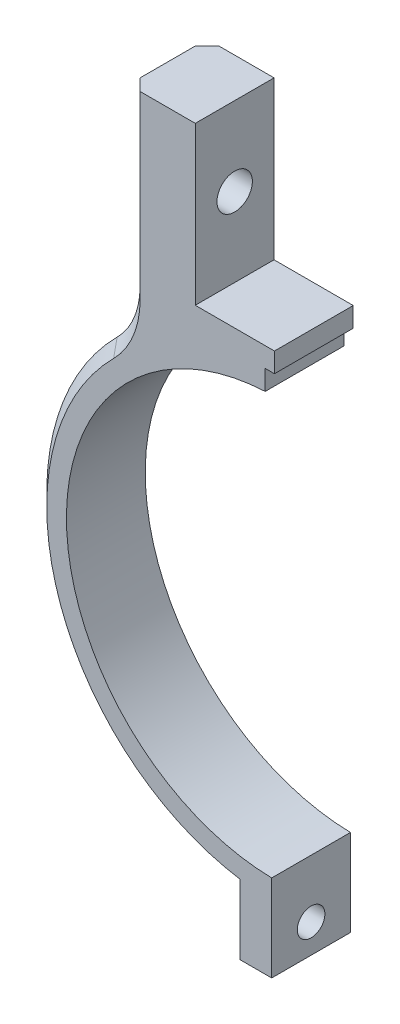
ISO-10303-21;
HEADER;
FILE_DESCRIPTION(('STEP AP214'),'2;1');
FILE_NAME('part.step','',(''),(''),'','','');
FILE_SCHEMA(('AUTOMOTIVE_DESIGN { 1 0 10303 214 1 1 1 1 }'));
ENDSEC;
DATA;
#1=APPLICATION_CONTEXT('core data for automotive mechanical design processes');
#2=APPLICATION_PROTOCOL_DEFINITION('international standard','automotive_design',2000,#1);
#3=PRODUCT_CONTEXT('',#1,'mechanical');
#4=PRODUCT('Part','Part','',(#3));
#5=PRODUCT_RELATED_PRODUCT_CATEGORY('part','',(#4));
#6=PRODUCT_DEFINITION_FORMATION('','',#4);
#7=PRODUCT_DEFINITION_CONTEXT('part definition',#1,'design');
#8=PRODUCT_DEFINITION('design','',#6,#7);
#9=PRODUCT_DEFINITION_SHAPE('','',#8);
#10=(LENGTH_UNIT() NAMED_UNIT(*) SI_UNIT(.MILLI.,.METRE.));
#11=(NAMED_UNIT(*) PLANE_ANGLE_UNIT() SI_UNIT($,.RADIAN.));
#12=(NAMED_UNIT(*) SI_UNIT($,.STERADIAN.) SOLID_ANGLE_UNIT());
#13=UNCERTAINTY_MEASURE_WITH_UNIT(LENGTH_MEASURE(1.E-05),#10,'distance_accuracy_value','');
#14=(GEOMETRIC_REPRESENTATION_CONTEXT(3) GLOBAL_UNCERTAINTY_ASSIGNED_CONTEXT((#13)) GLOBAL_UNIT_ASSIGNED_CONTEXT((#10,
#11,#12)) REPRESENTATION_CONTEXT('',''));
#15=CARTESIAN_POINT('',(0.,0.,0.));
#16=DIRECTION('',(0.,0.,1.));
#17=DIRECTION('',(1.,0.,0.));
#18=AXIS2_PLACEMENT_3D('',#15,#16,#17);
#19=CARTESIAN_POINT('',(-10.2,31.55,10.));
#20=DIRECTION('',(0.,-1.,0.));
#21=DIRECTION('',(0.,0.,-1.));
#22=AXIS2_PLACEMENT_3D('',#19,#20,#21);
#23=PLANE('',#22);
#24=DIRECTION('',(-1.,0.,0.));
#25=VECTOR('',#24,1.);
#26=CARTESIAN_POINT('',(-10.2,31.55,10.));
#27=LINE('',#26,#25);
#28=CARTESIAN_POINT('',(-0.15,31.55,10.));
#29=VERTEX_POINT('',#28);
#30=CARTESIAN_POINT('',(-10.2,31.55,10.));
#31=VERTEX_POINT('',#30);
#32=EDGE_CURVE('E208',#29,#31,#27,.T.);
#33=ORIENTED_EDGE('',*,*,#32,.F.);
#34=DIRECTION('',(0.,0.,1.));
#35=VECTOR('',#34,1.);
#36=CARTESIAN_POINT('',(-0.15,31.55,0.));
#37=LINE('',#36,#35);
#38=CARTESIAN_POINT('',(-0.15,31.55,0.));
#39=VERTEX_POINT('',#38);
#40=EDGE_CURVE('E170',#39,#29,#37,.T.);
#41=ORIENTED_EDGE('',*,*,#40,.F.);
#42=DIRECTION('',(-1.,0.,0.));
#43=VECTOR('',#42,1.);
#44=CARTESIAN_POINT('',(-10.2,31.55,0.));
#45=LINE('',#44,#43);
#46=CARTESIAN_POINT('',(-10.2,31.55,0.));
#47=VERTEX_POINT('',#46);
#48=EDGE_CURVE('E207',#39,#47,#45,.T.);
#49=ORIENTED_EDGE('',*,*,#48,.T.);
#50=DIRECTION('',(0.,0.,-1.));
#51=VECTOR('',#50,1.);
#52=CARTESIAN_POINT('',(-10.2,31.55,10.));
#53=LINE('',#52,#51);
#54=EDGE_CURVE('E257',#31,#47,#53,.T.);
#55=ORIENTED_EDGE('',*,*,#54,.F.);
#56=EDGE_LOOP('',(#33,#41,#49,#55));
#57=FACE_BOUND('',#56,.T.);
#58=ADVANCED_FACE('F38',(#57),#23,.F.);
#59=CARTESIAN_POINT('',(0.,0.,10.));
#60=DIRECTION('',(0.,0.,-1.));
#61=DIRECTION('',(-1.,0.,0.));
#62=AXIS2_PLACEMENT_3D('',#59,#60,#61);
#63=CYLINDRICAL_SURFACE('',#62,26.55);
#64=CARTESIAN_POINT('',(0.,0.,0.));
#65=DIRECTION('',(0.,0.,-1.));
#66=DIRECTION('',(1.,0.,0.));
#67=AXIS2_PLACEMENT_3D('',#64,#65,#66);
#68=CIRCLE('',#67,26.55);
#69=CARTESIAN_POINT('',(-0.50000000000001,-26.5452914845552,0.));
#70=VERTEX_POINT('',#69);
#71=CARTESIAN_POINT('',(-1.325,26.5169167702431,0.));
#72=VERTEX_POINT('',#71);
#73=EDGE_CURVE('E211',#70,#72,#68,.T.);
#74=ORIENTED_EDGE('',*,*,#73,.T.);
#75=DIRECTION('',(0.,0.,-1.));
#76=VECTOR('',#75,1.);
#77=CARTESIAN_POINT('',(-1.325,26.5169167702431,10.));
#78=LINE('',#77,#76);
#79=CARTESIAN_POINT('',(-1.325,26.5169167702431,10.));
#80=VERTEX_POINT('',#79);
#81=EDGE_CURVE('E57',#72,#80,#78,.F.);
#82=ORIENTED_EDGE('',*,*,#81,.T.);
#83=CARTESIAN_POINT('',(0.,0.,10.));
#84=DIRECTION('',(0.,0.,-1.));
#85=DIRECTION('',(1.,0.,0.));
#86=AXIS2_PLACEMENT_3D('',#83,#84,#85);
#87=CIRCLE('',#86,26.55);
#88=CARTESIAN_POINT('',(-0.50000000000001,-26.5452914845552,10.));
#89=VERTEX_POINT('',#88);
#90=EDGE_CURVE('E222',#89,#80,#87,.T.);
#91=ORIENTED_EDGE('',*,*,#90,.F.);
#92=DIRECTION('',(0.,0.,-1.));
#93=VECTOR('',#92,1.);
#94=CARTESIAN_POINT('',(-0.50000000000001,-26.5452914845552,10.));
#95=LINE('',#94,#93);
#96=EDGE_CURVE('E225',#89,#70,#95,.T.);
#97=ORIENTED_EDGE('',*,*,#96,.T.);
#98=EDGE_LOOP('',(#74,#82,#91,#97));
#99=FACE_BOUND('',#98,.T.);
#100=ADVANCED_FACE('F345',(#99),#63,.F.);
#101=CARTESIAN_POINT('',(0.,0.,10.));
#102=DIRECTION('',(0.,0.,1.));
#103=DIRECTION('',(1.,0.,0.));
#104=AXIS2_PLACEMENT_3D('',#101,#102,#103);
#105=PLANE('',#104);
#106=DIRECTION('',(0.,-1.,0.));
#107=VECTOR('',#106,1.);
#108=CARTESIAN_POINT('',(-0.15,29.05,10.));
#109=LINE('',#108,#107);
#110=CARTESIAN_POINT('',(-0.15,29.05,10.));
#111=VERTEX_POINT('',#110);
#112=EDGE_CURVE('E180',#29,#111,#109,.T.);
#113=ORIENTED_EDGE('',*,*,#112,.F.);
#114=ORIENTED_EDGE('',*,*,#32,.T.);
#115=DIRECTION('',(0.,1.,0.));
#116=VECTOR('',#115,1.);
#117=CARTESIAN_POINT('',(-10.2,31.55,10.));
#118=LINE('',#117,#116);
#119=CARTESIAN_POINT('',(-10.2,51.55,10.));
#120=VERTEX_POINT('',#119);
#121=EDGE_CURVE('E210',#31,#120,#118,.T.);
#122=ORIENTED_EDGE('',*,*,#121,.T.);
#123=DIRECTION('',(-1.,0.,0.));
#124=VECTOR('',#123,1.);
#125=CARTESIAN_POINT('',(-10.2,51.55,10.));
#126=LINE('',#125,#124);
#127=CARTESIAN_POINT('',(-17.2,51.55,10.));
#128=VERTEX_POINT('',#127);
#129=EDGE_CURVE('E213',#120,#128,#126,.T.);
#130=ORIENTED_EDGE('',*,*,#129,.T.);
#131=DIRECTION('',(0.,-1.,0.));
#132=VECTOR('',#131,1.);
#133=CARTESIAN_POINT('',(-17.2,28.6463348440948,10.));
#134=LINE('',#133,#132);
#135=CARTESIAN_POINT('',(-17.2,28.6463348440948,10.));
#136=VERTEX_POINT('',#135);
#137=EDGE_CURVE('E271',#128,#136,#134,.T.);
#138=ORIENTED_EDGE('',*,*,#137,.T.);
#139=CARTESIAN_POINT('',(-28.7,28.6463348440948,10.));
#140=DIRECTION('',(0.,0.,1.));
#141=DIRECTION('',(1.,0.,0.));
#142=AXIS2_PLACEMENT_3D('',#139,#140,#141);
#143=CIRCLE('',#142,11.5);
#144=CARTESIAN_POINT('',(-20.5606658446363,20.5222201534144,10.));
#145=VERTEX_POINT('',#144);
#146=EDGE_CURVE('E269',#136,#145,#143,.F.);
#147=ORIENTED_EDGE('',*,*,#146,.T.);
#148=CARTESIAN_POINT('',(0.,0.,10.));
#149=DIRECTION('',(0.,0.,1.));
#150=DIRECTION('',(1.,0.,0.));
#151=AXIS2_PLACEMENT_3D('',#148,#149,#150);
#152=CIRCLE('',#151,29.05);
#153=CARTESIAN_POINT('',(-4.5,-28.6993466824595,10.));
#154=VERTEX_POINT('',#153);
#155=EDGE_CURVE('E266',#145,#154,#152,.T.);
#156=ORIENTED_EDGE('',*,*,#155,.T.);
#157=DIRECTION('',(0.,-1.,0.));
#158=VECTOR('',#157,1.);
#159=CARTESIAN_POINT('',(-4.5,-37.5459080729318,10.));
#160=LINE('',#159,#158);
#161=CARTESIAN_POINT('',(-4.5,-37.5459080729318,10.));
#162=VERTEX_POINT('',#161);
#163=EDGE_CURVE('E216',#154,#162,#160,.T.);
#164=ORIENTED_EDGE('',*,*,#163,.T.);
#165=DIRECTION('',(1.,0.,0.));
#166=VECTOR('',#165,1.);
#167=CARTESIAN_POINT('',(-0.499999999999996,-37.5459080729318,10.));
#168=LINE('',#167,#166);
#169=CARTESIAN_POINT('',(-0.499999999999996,-37.5459080729318,10.));
#170=VERTEX_POINT('',#169);
#171=EDGE_CURVE('E218',#162,#170,#168,.T.);
#172=ORIENTED_EDGE('',*,*,#171,.T.);
#173=DIRECTION('',(0.,1.,0.));
#174=VECTOR('',#173,1.);
#175=CARTESIAN_POINT('',(-0.499999999999996,-30.5459080729318,10.));
#176=LINE('',#175,#174);
#177=EDGE_CURVE('E220',#170,#89,#176,.T.);
#178=ORIENTED_EDGE('',*,*,#177,.T.);
#179=ORIENTED_EDGE('',*,*,#90,.T.);
#180=DIRECTION('',(0.,-1.,0.));
#181=VECTOR('',#180,1.);
#182=CARTESIAN_POINT('',(-1.325,29.05,10.));
#183=LINE('',#182,#181);
#184=CARTESIAN_POINT('',(-1.325,29.05,10.));
#185=VERTEX_POINT('',#184);
#186=EDGE_CURVE('E183',#185,#80,#183,.T.);
#187=ORIENTED_EDGE('',*,*,#186,.F.);
#188=DIRECTION('',(-1.,0.,0.));
#189=VECTOR('',#188,1.);
#190=CARTESIAN_POINT('',(-0.15,29.05,10.));
#191=LINE('',#190,#189);
#192=EDGE_CURVE('E168',#111,#185,#191,.T.);
#193=ORIENTED_EDGE('',*,*,#192,.F.);
#194=EDGE_LOOP('',(#113,#114,#122,#130,#138,#147,#156,#164,#172,#178,#179,#187,#193));
#195=FACE_BOUND('',#194,.T.);
#196=ADVANCED_FACE('F351',(#195),#105,.T.);
#197=CARTESIAN_POINT('',(0.,0.,0.));
#198=DIRECTION('',(0.,0.,1.));
#199=DIRECTION('',(1.,0.,0.));
#200=AXIS2_PLACEMENT_3D('',#197,#198,#199);
#201=PLANE('',#200);
#202=ORIENTED_EDGE('',*,*,#48,.F.);
#203=DIRECTION('',(0.,-1.,0.));
#204=VECTOR('',#203,1.);
#205=CARTESIAN_POINT('',(-0.15,29.05,0.));
#206=LINE('',#205,#204);
#207=CARTESIAN_POINT('',(-0.15,29.05,0.));
#208=VERTEX_POINT('',#207);
#209=EDGE_CURVE('E171',#39,#208,#206,.T.);
#210=ORIENTED_EDGE('',*,*,#209,.T.);
#211=DIRECTION('',(-1.,0.,0.));
#212=VECTOR('',#211,1.);
#213=CARTESIAN_POINT('',(-0.15,29.05,0.));
#214=LINE('',#213,#212);
#215=CARTESIAN_POINT('',(-1.325,29.05,0.));
#216=VERTEX_POINT('',#215);
#217=EDGE_CURVE('E165',#208,#216,#214,.T.);
#218=ORIENTED_EDGE('',*,*,#217,.T.);
#219=DIRECTION('',(0.,-1.,0.));
#220=VECTOR('',#219,1.);
#221=CARTESIAN_POINT('',(-1.325,29.05,0.));
#222=LINE('',#221,#220);
#223=EDGE_CURVE('E173',#216,#72,#222,.T.);
#224=ORIENTED_EDGE('',*,*,#223,.T.);
#225=ORIENTED_EDGE('',*,*,#73,.F.);
#226=DIRECTION('',(0.,1.,0.));
#227=VECTOR('',#226,1.);
#228=CARTESIAN_POINT('',(-0.499999999999997,-26.5452914845552,0.));
#229=LINE('',#228,#227);
#230=CARTESIAN_POINT('',(-0.499999999999996,-37.5459080729318,0.));
#231=VERTEX_POINT('',#230);
#232=EDGE_CURVE('E237',#231,#70,#229,.T.);
#233=ORIENTED_EDGE('',*,*,#232,.F.);
#234=DIRECTION('',(1.,0.,0.));
#235=VECTOR('',#234,1.);
#236=CARTESIAN_POINT('',(-0.499999999999996,-37.5459080729318,0.));
#237=LINE('',#236,#235);
#238=CARTESIAN_POINT('',(-4.5,-37.5459080729318,0.));
#239=VERTEX_POINT('',#238);
#240=EDGE_CURVE('E234',#239,#231,#237,.T.);
#241=ORIENTED_EDGE('',*,*,#240,.F.);
#242=DIRECTION('',(0.,-1.,0.));
#243=VECTOR('',#242,1.);
#244=CARTESIAN_POINT('',(-4.5,-37.5459080729318,0.));
#245=LINE('',#244,#243);
#246=CARTESIAN_POINT('',(-4.5,-28.6993466824595,0.));
#247=VERTEX_POINT('',#246);
#248=EDGE_CURVE('E232',#247,#239,#245,.T.);
#249=ORIENTED_EDGE('',*,*,#248,.F.);
#250=CARTESIAN_POINT('',(0.,0.,0.));
#251=DIRECTION('',(0.,0.,1.));
#252=DIRECTION('',(1.,0.,0.));
#253=AXIS2_PLACEMENT_3D('',#250,#251,#252);
#254=CIRCLE('',#253,29.05);
#255=CARTESIAN_POINT('',(-20.5606658446363,20.5222201534144,0.));
#256=VERTEX_POINT('',#255);
#257=EDGE_CURVE('E293',#247,#256,#254,.F.);
#258=ORIENTED_EDGE('',*,*,#257,.T.);
#259=CARTESIAN_POINT('',(-28.7,28.6463348440948,0.));
#260=DIRECTION('',(0.,0.,1.));
#261=DIRECTION('',(1.,0.,0.));
#262=AXIS2_PLACEMENT_3D('',#259,#260,#261);
#263=CIRCLE('',#262,11.5);
#264=CARTESIAN_POINT('',(-17.2,28.6463348440948,0.));
#265=VERTEX_POINT('',#264);
#266=EDGE_CURVE('E65',#256,#265,#263,.T.);
#267=ORIENTED_EDGE('',*,*,#266,.T.);
#268=DIRECTION('',(0.,1.,0.));
#269=VECTOR('',#268,1.);
#270=CARTESIAN_POINT('',(-17.2,0.,0.));
#271=LINE('',#270,#269);
#272=CARTESIAN_POINT('',(-17.2,51.55,0.));
#273=VERTEX_POINT('',#272);
#274=EDGE_CURVE('E296',#265,#273,#271,.T.);
#275=ORIENTED_EDGE('',*,*,#274,.T.);
#276=DIRECTION('',(-1.,0.,0.));
#277=VECTOR('',#276,1.);
#278=CARTESIAN_POINT('',(-10.2,51.55,0.));
#279=LINE('',#278,#277);
#280=CARTESIAN_POINT('',(-10.2,51.55,0.));
#281=VERTEX_POINT('',#280);
#282=EDGE_CURVE('E229',#281,#273,#279,.T.);
#283=ORIENTED_EDGE('',*,*,#282,.F.);
#284=DIRECTION('',(0.,1.,0.));
#285=VECTOR('',#284,1.);
#286=CARTESIAN_POINT('',(-10.2,31.55,0.));
#287=LINE('',#286,#285);
#288=EDGE_CURVE('E227',#47,#281,#287,.T.);
#289=ORIENTED_EDGE('',*,*,#288,.F.);
#290=EDGE_LOOP('',(#202,#210,#218,#224,#225,#233,#241,#249,#258,#267,#275,#283,#289));
#291=FACE_BOUND('',#290,.T.);
#292=ADVANCED_FACE('F179',(#291),#201,.F.);
#293=CARTESIAN_POINT('',(-10.2,31.55,10.));
#294=DIRECTION('',(-1.,0.,0.));
#295=DIRECTION('',(0.,0.,1.));
#296=AXIS2_PLACEMENT_3D('',#293,#294,#295);
#297=PLANE('',#296);
#298=CARTESIAN_POINT('',(-10.2,41.55,5.));
#299=DIRECTION('',(-1.,0.,0.));
#300=DIRECTION('',(0.,0.,1.));
#301=AXIS2_PLACEMENT_3D('',#298,#299,#300);
#302=CIRCLE('',#301,2.25);
#303=CARTESIAN_POINT('',(-10.2,41.55,7.25));
#304=VERTEX_POINT('',#303);
#305=EDGE_CURVE('E197',#304,#304,#302,.T.);
#306=ORIENTED_EDGE('',*,*,#305,.T.);
#307=EDGE_LOOP('',(#306));
#308=FACE_BOUND('',#307,.T.);
#309=ORIENTED_EDGE('',*,*,#288,.T.);
#310=DIRECTION('',(0.,0.,-1.));
#311=VECTOR('',#310,1.);
#312=CARTESIAN_POINT('',(-10.2,51.55,10.));
#313=LINE('',#312,#311);
#314=EDGE_CURVE('E254',#120,#281,#313,.T.);
#315=ORIENTED_EDGE('',*,*,#314,.F.);
#316=ORIENTED_EDGE('',*,*,#121,.F.);
#317=ORIENTED_EDGE('',*,*,#54,.T.);
#318=EDGE_LOOP('',(#309,#315,#316,#317));
#319=FACE_BOUND('',#318,.T.);
#320=ADVANCED_FACE('F357',(#308,#319),#297,.F.);
#321=CARTESIAN_POINT('',(-10.2,51.55,10.));
#322=DIRECTION('',(0.,-1.,0.));
#323=DIRECTION('',(0.,0.,-1.));
#324=AXIS2_PLACEMENT_3D('',#321,#322,#323);
#325=PLANE('',#324);
#326=DIRECTION('',(0.,0.,-1.));
#327=VECTOR('',#326,1.);
#328=CARTESIAN_POINT('',(-18.7,51.55,10.));
#329=LINE('',#328,#327);
#330=CARTESIAN_POINT('',(-18.7,51.55,8.5));
#331=VERTEX_POINT('',#330);
#332=CARTESIAN_POINT('',(-18.7,51.55,1.49999999999999));
#333=VERTEX_POINT('',#332);
#334=EDGE_CURVE('E251',#331,#333,#329,.T.);
#335=ORIENTED_EDGE('',*,*,#334,.F.);
#336=DIRECTION('',(0.707106781186545,0.,0.70710678118655));
#337=VECTOR('',#336,1.);
#338=CARTESIAN_POINT('',(-17.2,51.55,10.));
#339=LINE('',#338,#337);
#340=EDGE_CURVE('E282',#331,#128,#339,.T.);
#341=ORIENTED_EDGE('',*,*,#340,.T.);
#342=ORIENTED_EDGE('',*,*,#129,.F.);
#343=ORIENTED_EDGE('',*,*,#314,.T.);
#344=ORIENTED_EDGE('',*,*,#282,.T.);
#345=DIRECTION('',(0.707106781186548,0.,-0.707106781186547));
#346=VECTOR('',#345,1.);
#347=CARTESIAN_POINT('',(-18.7,51.55,1.49999999999999));
#348=LINE('',#347,#346);
#349=EDGE_CURVE('E280',#273,#333,#348,.F.);
#350=ORIENTED_EDGE('',*,*,#349,.T.);
#351=EDGE_LOOP('',(#335,#341,#342,#343,#344,#350));
#352=FACE_BOUND('',#351,.T.);
#353=ADVANCED_FACE('F378',(#352),#325,.F.);
#354=CARTESIAN_POINT('',(-18.7,51.55,10.));
#355=DIRECTION('',(1.,0.,0.));
#356=DIRECTION('',(0.,1.,0.));
#357=AXIS2_PLACEMENT_3D('',#354,#355,#356);
#358=PLANE('',#357);
#359=CARTESIAN_POINT('',(-18.7,41.55,5.));
#360=DIRECTION('',(-1.,0.,0.));
#361=DIRECTION('',(0.,-1.,0.));
#362=AXIS2_PLACEMENT_3D('',#359,#360,#361);
#363=CIRCLE('',#362,2.25);
#364=CARTESIAN_POINT('',(-18.7,39.3,5.));
#365=VERTEX_POINT('',#364);
#366=EDGE_CURVE('E194',#365,#365,#363,.T.);
#367=ORIENTED_EDGE('',*,*,#366,.F.);
#368=EDGE_LOOP('',(#367));
#369=FACE_BOUND('',#368,.T.);
#370=DIRECTION('',(0.,0.,1.));
#371=VECTOR('',#370,1.);
#372=CARTESIAN_POINT('',(-18.7,28.6463348440948,10.));
#373=LINE('',#372,#371);
#374=CARTESIAN_POINT('',(-18.7,28.6463348440948,1.49999999999999));
#375=VERTEX_POINT('',#374);
#376=CARTESIAN_POINT('',(-18.7,28.6463348440948,8.5));
#377=VERTEX_POINT('',#376);
#378=EDGE_CURVE('E263',#375,#377,#373,.T.);
#379=ORIENTED_EDGE('',*,*,#378,.T.);
#380=DIRECTION('',(0.,1.,0.));
#381=VECTOR('',#380,1.);
#382=CARTESIAN_POINT('',(-18.7,51.55,8.5));
#383=LINE('',#382,#381);
#384=EDGE_CURVE('E278',#377,#331,#383,.T.);
#385=ORIENTED_EDGE('',*,*,#384,.T.);
#386=ORIENTED_EDGE('',*,*,#334,.T.);
#387=DIRECTION('',(0.,-1.,0.));
#388=VECTOR('',#387,1.);
#389=CARTESIAN_POINT('',(-18.7,51.55,1.49999999999999));
#390=LINE('',#389,#388);
#391=EDGE_CURVE('E274',#333,#375,#390,.T.);
#392=ORIENTED_EDGE('',*,*,#391,.T.);
#393=EDGE_LOOP('',(#379,#385,#386,#392));
#394=FACE_BOUND('',#393,.T.);
#395=ADVANCED_FACE('F453',(#369,#394),#358,.F.);
#396=CARTESIAN_POINT('',(0.,0.,10.));
#397=DIRECTION('',(0.,0.,-1.));
#398=DIRECTION('',(-1.,0.,0.));
#399=AXIS2_PLACEMENT_3D('',#396,#397,#398);
#400=CYLINDRICAL_SURFACE('',#399,30.55);
#401=DIRECTION('',(0.,0.,-1.));
#402=VECTOR('',#401,1.);
#403=CARTESIAN_POINT('',(-4.5,-30.2167585951902,10.));
#404=LINE('',#403,#402);
#405=CARTESIAN_POINT('',(-4.5,-30.2167585951902,8.5));
#406=VERTEX_POINT('',#405);
#407=CARTESIAN_POINT('',(-4.5,-30.2167585951902,1.49999999999999));
#408=VERTEX_POINT('',#407);
#409=EDGE_CURVE('E248',#406,#408,#404,.T.);
#410=ORIENTED_EDGE('',*,*,#409,.F.);
#411=CARTESIAN_POINT('',(0.,0.,8.5));
#412=DIRECTION('',(0.,0.,1.));
#413=DIRECTION('',(1.,0.,0.));
#414=AXIS2_PLACEMENT_3D('',#411,#412,#413);
#415=CIRCLE('',#414,30.55);
#416=CARTESIAN_POINT('',(-21.6223181257707,21.5818872869814,8.5));
#417=VERTEX_POINT('',#416);
#418=EDGE_CURVE('E291',#406,#417,#415,.F.);
#419=ORIENTED_EDGE('',*,*,#418,.T.);
#420=DIRECTION('',(0.,0.,-1.));
#421=VECTOR('',#420,1.);
#422=CARTESIAN_POINT('',(-21.6223181257707,21.5818872869814,10.));
#423=LINE('',#422,#421);
#424=CARTESIAN_POINT('',(-21.6223181257707,21.5818872869814,1.49999999999999));
#425=VERTEX_POINT('',#424);
#426=EDGE_CURVE('E260',#417,#425,#423,.T.);
#427=ORIENTED_EDGE('',*,*,#426,.T.);
#428=CARTESIAN_POINT('',(0.,0.,1.49999999999999));
#429=DIRECTION('',(0.,0.,1.));
#430=DIRECTION('',(1.,0.,0.));
#431=AXIS2_PLACEMENT_3D('',#428,#429,#430);
#432=CIRCLE('',#431,30.55);
#433=EDGE_CURVE('E289',#425,#408,#432,.T.);
#434=ORIENTED_EDGE('',*,*,#433,.T.);
#435=EDGE_LOOP('',(#410,#419,#427,#434));
#436=FACE_BOUND('',#435,.T.);
#437=ADVANCED_FACE('F405',(#436),#400,.T.);
#438=CARTESIAN_POINT('',(-4.5,-37.5459080729318,10.));
#439=DIRECTION('',(1.,0.,0.));
#440=DIRECTION('',(0.,1.,0.));
#441=AXIS2_PLACEMENT_3D('',#438,#439,#440);
#442=PLANE('',#441);
#443=CARTESIAN_POINT('',(-4.50000000000001,-33.881333334061,5.));
#444=DIRECTION('',(-1.,0.,0.));
#445=DIRECTION('',(0.,0.,1.));
#446=AXIS2_PLACEMENT_3D('',#443,#444,#445);
#447=CIRCLE('',#446,1.75);
#448=CARTESIAN_POINT('',(-4.50000000000001,-33.881333334061,6.75));
#449=VERTEX_POINT('',#448);
#450=EDGE_CURVE('E201',#449,#449,#447,.T.);
#451=ORIENTED_EDGE('',*,*,#450,.F.);
#452=EDGE_LOOP('',(#451));
#453=FACE_BOUND('',#452,.T.);
#454=ORIENTED_EDGE('',*,*,#248,.T.);
#455=DIRECTION('',(0.,0.,-1.));
#456=VECTOR('',#455,1.);
#457=CARTESIAN_POINT('',(-4.5,-37.5459080729318,10.));
#458=LINE('',#457,#456);
#459=EDGE_CURVE('E245',#162,#239,#458,.T.);
#460=ORIENTED_EDGE('',*,*,#459,.F.);
#461=ORIENTED_EDGE('',*,*,#163,.F.);
#462=CARTESIAN_POINT('',(-4.5,-28.6993466824595,10.));
#463=CARTESIAN_POINT('',(-4.5,-28.9523221236118,9.75007430809185));
#464=CARTESIAN_POINT('',(-4.5,-29.2052608369842,9.50011146206985));
#465=CARTESIAN_POINT('',(-4.5,-29.7110648078943,9.00011146206977));
#466=CARTESIAN_POINT('',(-4.5,-29.9639300654322,8.75007430809177));
#467=CARTESIAN_POINT('',(-4.5,-30.2167585951902,8.5));
#468=B_SPLINE_CURVE_WITH_KNOTS('',3,(#462,#463,#464,#465,#466,#467),.UNSPECIFIED.,.F.,.F.,(4,2,
4),(0.,1.06683398615948,2.13366797115995),.UNSPECIFIED.);
#469=EDGE_CURVE('E49',#154,#406,#468,.T.);
#470=ORIENTED_EDGE('',*,*,#469,.T.);
#471=ORIENTED_EDGE('',*,*,#409,.T.);
#472=CARTESIAN_POINT('',(-4.5,-30.2167585951902,1.49999999999999));
#473=CARTESIAN_POINT('',(-4.5,-29.9639300654322,1.24992569190823));
#474=CARTESIAN_POINT('',(-4.5,-29.7110648078943,0.999888537930223));
#475=CARTESIAN_POINT('',(-4.5,-29.2052608369841,0.499888537930146));
#476=CARTESIAN_POINT('',(-4.5,-28.9523221236118,0.249925691908151));
#477=CARTESIAN_POINT('',(-4.5,-28.6993466824595,0.));
#478=B_SPLINE_CURVE_WITH_KNOTS('',3,(#472,#473,#474,#475,#476,#477),.UNSPECIFIED.,.F.,.F.,(4,2,
4),(0.,1.06683398500047,2.13366797115995),.UNSPECIFIED.);
#479=EDGE_CURVE('E11',#408,#247,#478,.T.);
#480=ORIENTED_EDGE('',*,*,#479,.T.);
#481=EDGE_LOOP('',(#454,#460,#461,#470,#471,#480));
#482=FACE_BOUND('',#481,.T.);
#483=ADVANCED_FACE('F309',(#453,#482),#442,.F.);
#484=CARTESIAN_POINT('',(-0.499999999999996,-37.5459080729318,10.));
#485=DIRECTION('',(0.,1.,0.));
#486=DIRECTION('',(0.,0.,1.));
#487=AXIS2_PLACEMENT_3D('',#484,#485,#486);
#488=PLANE('',#487);
#489=ORIENTED_EDGE('',*,*,#240,.T.);
#490=DIRECTION('',(0.,0.,-1.));
#491=VECTOR('',#490,1.);
#492=CARTESIAN_POINT('',(-0.499999999999996,-37.5459080729318,10.));
#493=LINE('',#492,#491);
#494=EDGE_CURVE('E242',#170,#231,#493,.T.);
#495=ORIENTED_EDGE('',*,*,#494,.F.);
#496=ORIENTED_EDGE('',*,*,#171,.F.);
#497=ORIENTED_EDGE('',*,*,#459,.T.);
#498=EDGE_LOOP('',(#489,#495,#496,#497));
#499=FACE_BOUND('',#498,.T.);
#500=ADVANCED_FACE('F413',(#499),#488,.F.);
#501=CARTESIAN_POINT('',(-0.499999999999997,-26.5452914845552,10.));
#502=DIRECTION('',(-1.,0.,0.));
#503=DIRECTION('',(0.,-1.,0.));
#504=AXIS2_PLACEMENT_3D('',#501,#502,#503);
#505=PLANE('',#504);
#506=CARTESIAN_POINT('',(-0.499999999999997,-33.881333334061,5.));
#507=DIRECTION('',(-1.,0.,0.));
#508=DIRECTION('',(0.,-1.,0.));
#509=AXIS2_PLACEMENT_3D('',#506,#507,#508);
#510=CIRCLE('',#509,1.75);
#511=CARTESIAN_POINT('',(-0.499999999999997,-35.631333334061,5.));
#512=VERTEX_POINT('',#511);
#513=EDGE_CURVE('E204',#512,#512,#510,.T.);
#514=ORIENTED_EDGE('',*,*,#513,.T.);
#515=EDGE_LOOP('',(#514));
#516=FACE_BOUND('',#515,.T.);
#517=ORIENTED_EDGE('',*,*,#232,.T.);
#518=ORIENTED_EDGE('',*,*,#96,.F.);
#519=ORIENTED_EDGE('',*,*,#177,.F.);
#520=ORIENTED_EDGE('',*,*,#494,.T.);
#521=EDGE_LOOP('',(#517,#518,#519,#520));
#522=FACE_BOUND('',#521,.T.);
#523=ADVANCED_FACE('F417',(#516,#522),#505,.F.);
#524=CARTESIAN_POINT('',(30.55,-33.881333334061,5.));
#525=DIRECTION('',(-1.,0.,0.));
#526=DIRECTION('',(0.,0.,1.));
#527=AXIS2_PLACEMENT_3D('',#524,#525,#526);
#528=CYLINDRICAL_SURFACE('',#527,1.75);
#529=ORIENTED_EDGE('',*,*,#450,.T.);
#530=EDGE_LOOP('',(#529));
#531=FACE_BOUND('',#530,.T.);
#532=ORIENTED_EDGE('',*,*,#513,.F.);
#533=EDGE_LOOP('',(#532));
#534=FACE_BOUND('',#533,.T.);
#535=ADVANCED_FACE('F434',(#531,#534),#528,.F.);
#536=CARTESIAN_POINT('',(30.55,41.55,5.));
#537=DIRECTION('',(-1.,0.,0.));
#538=DIRECTION('',(0.,-1.,0.));
#539=AXIS2_PLACEMENT_3D('',#536,#537,#538);
#540=CYLINDRICAL_SURFACE('',#539,2.25);
#541=ORIENTED_EDGE('',*,*,#366,.T.);
#542=EDGE_LOOP('',(#541));
#543=FACE_BOUND('',#542,.T.);
#544=ORIENTED_EDGE('',*,*,#305,.F.);
#545=EDGE_LOOP('',(#544));
#546=FACE_BOUND('',#545,.T.);
#547=ADVANCED_FACE('F360',(#543,#546),#540,.F.);
#548=CARTESIAN_POINT('',(-28.7,28.6463348440948,10.));
#549=DIRECTION('',(0.,0.,-1.));
#550=DIRECTION('',(-1.,0.,0.));
#551=AXIS2_PLACEMENT_3D('',#548,#549,#550);
#552=CYLINDRICAL_SURFACE('',#551,10.);
#553=ORIENTED_EDGE('',*,*,#426,.F.);
#554=CARTESIAN_POINT('',(-28.7,28.6463348440948,8.5));
#555=DIRECTION('',(0.,0.,1.));
#556=DIRECTION('',(1.,0.,0.));
#557=AXIS2_PLACEMENT_3D('',#554,#555,#556);
#558=CIRCLE('',#557,10.);
#559=EDGE_CURVE('E287',#417,#377,#558,.T.);
#560=ORIENTED_EDGE('',*,*,#559,.T.);
#561=ORIENTED_EDGE('',*,*,#378,.F.);
#562=CARTESIAN_POINT('',(-28.7,28.6463348440948,1.49999999999999));
#563=DIRECTION('',(0.,0.,1.));
#564=DIRECTION('',(1.,0.,0.));
#565=AXIS2_PLACEMENT_3D('',#562,#563,#564);
#566=CIRCLE('',#565,10.);
#567=EDGE_CURVE('E284',#375,#425,#566,.F.);
#568=ORIENTED_EDGE('',*,*,#567,.T.);
#569=EDGE_LOOP('',(#553,#560,#561,#568));
#570=FACE_BOUND('',#569,.T.);
#571=ADVANCED_FACE('F323',(#570),#552,.F.);
#572=CARTESIAN_POINT('',(0.,0.,10.));
#573=DIRECTION('',(0.,0.,-1.));
#574=DIRECTION('',(-1.,0.,0.));
#575=AXIS2_PLACEMENT_3D('',#572,#573,#574);
#576=CONICAL_SURFACE('',#575,29.05,0.785398163397445);
#577=ORIENTED_EDGE('',*,*,#469,.F.);
#578=ORIENTED_EDGE('',*,*,#155,.F.);
#579=DIRECTION('',(0.500467684834867,-0.499531877297161,0.70710678118655));
#580=VECTOR('',#579,1.);
#581=CARTESIAN_POINT('',(-21.6223181257707,21.5818872869814,8.5));
#582=LINE('',#581,#580);
#583=EDGE_CURVE('E198',#417,#145,#582,.T.);
#584=ORIENTED_EDGE('',*,*,#583,.F.);
#585=ORIENTED_EDGE('',*,*,#418,.F.);
#586=EDGE_LOOP('',(#577,#578,#584,#585));
#587=FACE_BOUND('',#586,.T.);
#588=ADVANCED_FACE('F314',(#587),#576,.T.);
#589=CARTESIAN_POINT('',(-28.7,28.6463348440948,10.));
#590=DIRECTION('',(0.,0.,1.));
#591=DIRECTION('',(1.,0.,0.));
#592=AXIS2_PLACEMENT_3D('',#589,#590,#591);
#593=CONICAL_SURFACE('',#592,11.5,0.785398163397445);
#594=ORIENTED_EDGE('',*,*,#583,.T.);
#595=ORIENTED_EDGE('',*,*,#146,.F.);
#596=DIRECTION('',(0.707106781186545,0.,0.70710678118655));
#597=VECTOR('',#596,1.);
#598=CARTESIAN_POINT('',(-18.7,28.6463348440948,8.5));
#599=LINE('',#598,#597);
#600=EDGE_CURVE('E391',#377,#136,#599,.T.);
#601=ORIENTED_EDGE('',*,*,#600,.F.);
#602=ORIENTED_EDGE('',*,*,#559,.F.);
#603=EDGE_LOOP('',(#594,#595,#601,#602));
#604=FACE_BOUND('',#603,.T.);
#605=ADVANCED_FACE('F322',(#604),#593,.F.);
#606=CARTESIAN_POINT('',(-17.2,0.,10.));
#607=DIRECTION('',(-0.70710678118655,0.,0.707106781186545));
#608=DIRECTION('',(0.,1.,0.));
#609=AXIS2_PLACEMENT_3D('',#606,#607,#608);
#610=PLANE('',#609);
#611=ORIENTED_EDGE('',*,*,#340,.F.);
#612=ORIENTED_EDGE('',*,*,#384,.F.);
#613=ORIENTED_EDGE('',*,*,#600,.T.);
#614=ORIENTED_EDGE('',*,*,#137,.F.);
#615=EDGE_LOOP('',(#611,#612,#613,#614));
#616=FACE_BOUND('',#615,.T.);
#617=ADVANCED_FACE('F341',(#616),#610,.T.);
#618=CARTESIAN_POINT('',(0.,0.,1.49999999999999));
#619=DIRECTION('',(0.,0.,1.));
#620=DIRECTION('',(1.,0.,0.));
#621=AXIS2_PLACEMENT_3D('',#618,#619,#620);
#622=CONICAL_SURFACE('',#621,30.55,0.785398163397449);
#623=ORIENTED_EDGE('',*,*,#479,.F.);
#624=ORIENTED_EDGE('',*,*,#433,.F.);
#625=DIRECTION('',(-0.50046768483487,0.499531877297162,0.707106781186546));
#626=VECTOR('',#625,1.);
#627=CARTESIAN_POINT('',(-20.5606658446363,20.5222201534144,0.));
#628=LINE('',#627,#626);
#629=EDGE_CURVE('E44',#256,#425,#628,.T.);
#630=ORIENTED_EDGE('',*,*,#629,.F.);
#631=ORIENTED_EDGE('',*,*,#257,.F.);
#632=EDGE_LOOP('',(#623,#624,#630,#631));
#633=FACE_BOUND('',#632,.T.);
#634=ADVANCED_FACE('F41',(#633),#622,.T.);
#635=CARTESIAN_POINT('',(-28.7,28.6463348440948,0.));
#636=DIRECTION('',(0.,0.,-1.));
#637=DIRECTION('',(-1.,0.,0.));
#638=AXIS2_PLACEMENT_3D('',#635,#636,#637);
#639=CONICAL_SURFACE('',#638,11.5,0.785398163397449);
#640=ORIENTED_EDGE('',*,*,#629,.T.);
#641=ORIENTED_EDGE('',*,*,#567,.F.);
#642=DIRECTION('',(-0.707106781186549,0.,0.707106781186546));
#643=VECTOR('',#642,1.);
#644=CARTESIAN_POINT('',(-17.2,28.6463348440948,0.));
#645=LINE('',#644,#643);
#646=EDGE_CURVE('E193',#265,#375,#645,.T.);
#647=ORIENTED_EDGE('',*,*,#646,.F.);
#648=ORIENTED_EDGE('',*,*,#266,.F.);
#649=EDGE_LOOP('',(#640,#641,#647,#648));
#650=FACE_BOUND('',#649,.T.);
#651=ADVANCED_FACE('F332',(#650),#639,.F.);
#652=CARTESIAN_POINT('',(-18.7,51.55,1.49999999999999));
#653=DIRECTION('',(0.707106781186547,0.,0.707106781186548));
#654=DIRECTION('',(0.,-1.,0.));
#655=AXIS2_PLACEMENT_3D('',#652,#653,#654);
#656=PLANE('',#655);
#657=ORIENTED_EDGE('',*,*,#349,.F.);
#658=ORIENTED_EDGE('',*,*,#274,.F.);
#659=ORIENTED_EDGE('',*,*,#646,.T.);
#660=ORIENTED_EDGE('',*,*,#391,.F.);
#661=EDGE_LOOP('',(#657,#658,#659,#660));
#662=FACE_BOUND('',#661,.T.);
#663=ADVANCED_FACE('F327',(#662),#656,.F.);
#664=CARTESIAN_POINT('',(-1.325,29.05,0.));
#665=DIRECTION('',(-1.,0.,0.));
#666=DIRECTION('',(0.,-1.,0.));
#667=AXIS2_PLACEMENT_3D('',#664,#665,#666);
#668=PLANE('',#667);
#669=ORIENTED_EDGE('',*,*,#223,.F.);
#670=DIRECTION('',(0.,0.,1.));
#671=VECTOR('',#670,1.);
#672=CARTESIAN_POINT('',(-1.325,29.05,0.));
#673=LINE('',#672,#671);
#674=EDGE_CURVE('E162',#216,#185,#673,.T.);
#675=ORIENTED_EDGE('',*,*,#674,.T.);
#676=ORIENTED_EDGE('',*,*,#186,.T.);
#677=ORIENTED_EDGE('',*,*,#81,.F.);
#678=EDGE_LOOP('',(#669,#675,#676,#677));
#679=FACE_BOUND('',#678,.T.);
#680=ADVANCED_FACE('F174',(#679),#668,.F.);
#681=CARTESIAN_POINT('',(-0.15,29.05,0.));
#682=DIRECTION('',(0.,1.,0.));
#683=DIRECTION('',(0.,0.,1.));
#684=AXIS2_PLACEMENT_3D('',#681,#682,#683);
#685=PLANE('',#684);
#686=ORIENTED_EDGE('',*,*,#192,.T.);
#687=ORIENTED_EDGE('',*,*,#674,.F.);
#688=ORIENTED_EDGE('',*,*,#217,.F.);
#689=DIRECTION('',(0.,0.,1.));
#690=VECTOR('',#689,1.);
#691=CARTESIAN_POINT('',(-0.15,29.05,0.));
#692=LINE('',#691,#690);
#693=EDGE_CURVE('E189',#208,#111,#692,.T.);
#694=ORIENTED_EDGE('',*,*,#693,.T.);
#695=EDGE_LOOP('',(#686,#687,#688,#694));
#696=FACE_BOUND('',#695,.T.);
#697=ADVANCED_FACE('F163',(#696),#685,.F.);
#698=CARTESIAN_POINT('',(-0.15,29.05,0.));
#699=DIRECTION('',(-1.,0.,0.));
#700=DIRECTION('',(0.,0.,1.));
#701=AXIS2_PLACEMENT_3D('',#698,#699,#700);
#702=PLANE('',#701);
#703=ORIENTED_EDGE('',*,*,#112,.T.);
#704=ORIENTED_EDGE('',*,*,#693,.F.);
#705=ORIENTED_EDGE('',*,*,#209,.F.);
#706=ORIENTED_EDGE('',*,*,#40,.T.);
#707=EDGE_LOOP('',(#703,#704,#705,#706));
#708=FACE_BOUND('',#707,.T.);
#709=ADVANCED_FACE('F422',(#708),#702,.F.);
#710=CLOSED_SHELL('',(#58,#100,#196,#292,#320,#353,#395,#437,#483,#500,#523,#535,#547,#571,#588,
#605,#617,#634,#651,#663,#680,#697,#709));
#711=MANIFOLD_SOLID_BREP('B2',#710);
#712=ADVANCED_BREP_SHAPE_REPRESENTATION('',(#18,#711),#14);
#713=SHAPE_DEFINITION_REPRESENTATION(#9,#712);
ENDSEC;
END-ISO-10303-21;
